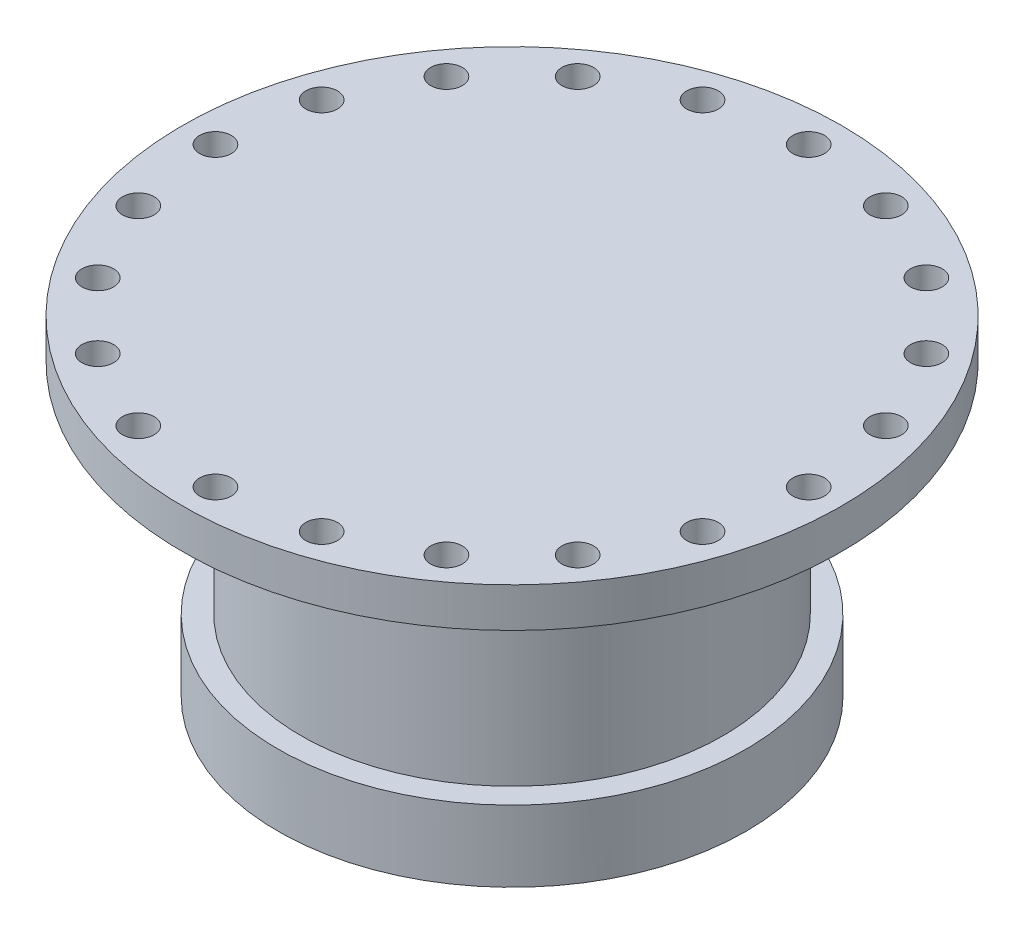
ISO-10303-21;
HEADER;
FILE_DESCRIPTION(('STEP AP214'),'2;1');
FILE_NAME('part.step','',(''),(''),'','','');
FILE_SCHEMA(('AUTOMOTIVE_DESIGN { 1 0 10303 214 1 1 1 1 }'));
ENDSEC;
DATA;
#1=APPLICATION_CONTEXT('core data for automotive mechanical design processes');
#2=APPLICATION_PROTOCOL_DEFINITION('international standard','automotive_design',2000,#1);
#3=PRODUCT_CONTEXT('',#1,'mechanical');
#4=PRODUCT('Part','Part','',(#3));
#5=PRODUCT_RELATED_PRODUCT_CATEGORY('part','',(#4));
#6=PRODUCT_DEFINITION_FORMATION('','',#4);
#7=PRODUCT_DEFINITION_CONTEXT('part definition',#1,'design');
#8=PRODUCT_DEFINITION('design','',#6,#7);
#9=PRODUCT_DEFINITION_SHAPE('','',#8);
#10=(LENGTH_UNIT() NAMED_UNIT(*) SI_UNIT(.MILLI.,.METRE.));
#11=(NAMED_UNIT(*) PLANE_ANGLE_UNIT() SI_UNIT($,.RADIAN.));
#12=(NAMED_UNIT(*) SI_UNIT($,.STERADIAN.) SOLID_ANGLE_UNIT());
#13=UNCERTAINTY_MEASURE_WITH_UNIT(LENGTH_MEASURE(1.E-05),#10,'distance_accuracy_value','');
#14=(GEOMETRIC_REPRESENTATION_CONTEXT(3) GLOBAL_UNCERTAINTY_ASSIGNED_CONTEXT((#13)) GLOBAL_UNIT_ASSIGNED_CONTEXT((#10,
#11,#12)) REPRESENTATION_CONTEXT('',''));
#15=CARTESIAN_POINT('',(0.,0.,0.));
#16=DIRECTION('',(0.,0.,1.));
#17=DIRECTION('',(1.,0.,0.));
#18=AXIS2_PLACEMENT_3D('',#15,#16,#17);
#19=CARTESIAN_POINT('',(0.,0.,0.));
#20=DIRECTION('',(0.,-1.,0.));
#21=DIRECTION('',(1.,0.,0.));
#22=AXIS2_PLACEMENT_3D('',#19,#20,#21);
#23=SPHERICAL_SURFACE('',#22,3950.);
#24=CARTESIAN_POINT('',(0.,3946.00985173631,0.));
#25=DIRECTION('',(0.,-1.,0.));
#26=DIRECTION('',(0.,0.,-1.));
#27=AXIS2_PLACEMENT_3D('',#24,#25,#26);
#28=CIRCLE('',#27,177.5);
#29=CARTESIAN_POINT('',(0.,3946.00985173631,-177.5));
#30=VERTEX_POINT('',#29);
#31=EDGE_CURVE('E10',#30,#30,#28,.T.);
#32=ORIENTED_EDGE('',*,*,#31,.T.);
#33=EDGE_LOOP('',(#32));
#34=FACE_BOUND('',#33,.T.);
#35=ADVANCED_FACE('F32',(#34),#23,.F.);
#36=CARTESIAN_POINT('',(0.,113.656700563518,0.));
#37=DIRECTION('',(0.,-1.,0.));
#38=DIRECTION('',(0.,0.,-1.));
#39=AXIS2_PLACEMENT_3D('',#36,#37,#38);
#40=CYLINDRICAL_SURFACE('',#39,177.5);
#41=CARTESIAN_POINT('',(0.,4000.,0.));
#42=DIRECTION('',(0.,-1.,0.));
#43=DIRECTION('',(0.,0.,-1.));
#44=AXIS2_PLACEMENT_3D('',#41,#42,#43);
#45=CIRCLE('',#44,177.5);
#46=CARTESIAN_POINT('',(0.,4000.,-177.5));
#47=VERTEX_POINT('',#46);
#48=EDGE_CURVE('E39',#47,#47,#45,.T.);
#49=ORIENTED_EDGE('',*,*,#48,.T.);
#50=EDGE_LOOP('',(#49));
#51=FACE_BOUND('',#50,.T.);
#52=ORIENTED_EDGE('',*,*,#31,.F.);
#53=EDGE_LOOP('',(#52));
#54=FACE_BOUND('',#53,.T.);
#55=ADVANCED_FACE('F272',(#51,#54),#40,.T.);
#56=CARTESIAN_POINT('',(160.,4000.,0.));
#57=DIRECTION('',(0.,1.,0.));
#58=DIRECTION('',(0.,0.,1.));
#59=AXIS2_PLACEMENT_3D('',#56,#57,#58);
#60=PLANE('',#59);
#61=CARTESIAN_POINT('',(0.,4000.,0.));
#62=DIRECTION('',(0.,-1.,0.));
#63=DIRECTION('',(0.,0.,-1.));
#64=AXIS2_PLACEMENT_3D('',#61,#62,#63);
#65=CIRCLE('',#64,160.);
#66=CARTESIAN_POINT('',(0.,4000.,-160.));
#67=VERTEX_POINT('',#66);
#68=EDGE_CURVE('E43',#67,#67,#65,.T.);
#69=ORIENTED_EDGE('',*,*,#68,.T.);
#70=EDGE_LOOP('',(#69));
#71=FACE_BOUND('',#70,.T.);
#72=ORIENTED_EDGE('',*,*,#48,.F.);
#73=EDGE_LOOP('',(#72));
#74=FACE_BOUND('',#73,.T.);
#75=ADVANCED_FACE('F266',(#71,#74),#60,.T.);
#76=CARTESIAN_POINT('',(0.,113.656700563518,0.));
#77=DIRECTION('',(0.,-1.,0.));
#78=DIRECTION('',(0.,0.,-1.));
#79=AXIS2_PLACEMENT_3D('',#76,#77,#78);
#80=CYLINDRICAL_SURFACE('',#79,160.);
#81=CARTESIAN_POINT('',(0.,4160.,0.));
#82=DIRECTION('',(0.,-1.,0.));
#83=DIRECTION('',(0.,0.,-1.));
#84=AXIS2_PLACEMENT_3D('',#81,#82,#83);
#85=CIRCLE('',#84,160.);
#86=CARTESIAN_POINT('',(0.,4160.,-160.));
#87=VERTEX_POINT('',#86);
#88=EDGE_CURVE('E47',#87,#87,#85,.T.);
#89=ORIENTED_EDGE('',*,*,#88,.T.);
#90=EDGE_LOOP('',(#89));
#91=FACE_BOUND('',#90,.T.);
#92=ORIENTED_EDGE('',*,*,#68,.F.);
#93=EDGE_LOOP('',(#92));
#94=FACE_BOUND('',#93,.T.);
#95=ADVANCED_FACE('F260',(#91,#94),#80,.T.);
#96=CARTESIAN_POINT('',(174.,4160.,0.));
#97=DIRECTION('',(0.,-1.,0.));
#98=DIRECTION('',(0.,0.,-1.));
#99=AXIS2_PLACEMENT_3D('',#96,#97,#98);
#100=PLANE('',#99);
#101=CARTESIAN_POINT('',(0.,4160.,0.));
#102=DIRECTION('',(0.,-1.,0.));
#103=DIRECTION('',(0.,0.,-1.));
#104=AXIS2_PLACEMENT_3D('',#101,#102,#103);
#105=CIRCLE('',#104,174.);
#106=CARTESIAN_POINT('',(0.,4160.,-174.));
#107=VERTEX_POINT('',#106);
#108=EDGE_CURVE('E52',#107,#107,#105,.T.);
#109=ORIENTED_EDGE('',*,*,#108,.T.);
#110=EDGE_LOOP('',(#109));
#111=FACE_BOUND('',#110,.T.);
#112=ORIENTED_EDGE('',*,*,#88,.F.);
#113=EDGE_LOOP('',(#112));
#114=FACE_BOUND('',#113,.T.);
#115=ADVANCED_FACE('F254',(#111,#114),#100,.T.);
#116=CARTESIAN_POINT('',(0.,4160.,0.));
#117=DIRECTION('',(0.,1.,0.));
#118=DIRECTION('',(0.,0.,1.));
#119=AXIS2_PLACEMENT_3D('',#116,#117,#118);
#120=CONICAL_SURFACE('',#119,174.,0.78539816339743);
#121=CARTESIAN_POINT('',(0.,4166.,0.));
#122=DIRECTION('',(0.,-1.,0.));
#123=DIRECTION('',(0.,0.,-1.));
#124=AXIS2_PLACEMENT_3D('',#121,#122,#123);
#125=CIRCLE('',#124,180.);
#126=CARTESIAN_POINT('',(0.,4166.,-180.));
#127=VERTEX_POINT('',#126);
#128=EDGE_CURVE('E55',#127,#127,#125,.T.);
#129=ORIENTED_EDGE('',*,*,#128,.T.);
#130=EDGE_LOOP('',(#129));
#131=FACE_BOUND('',#130,.T.);
#132=ORIENTED_EDGE('',*,*,#108,.F.);
#133=EDGE_LOOP('',(#132));
#134=FACE_BOUND('',#133,.T.);
#135=ADVANCED_FACE('F247',(#131,#134),#120,.T.);
#136=CARTESIAN_POINT('',(250.,4166.,0.));
#137=DIRECTION('',(0.,-1.,0.));
#138=DIRECTION('',(0.,0.,-1.));
#139=AXIS2_PLACEMENT_3D('',#136,#137,#138);
#140=PLANE('',#139);
#141=CARTESIAN_POINT('',(-69.5288237343604,4166.,-213.98771616641));
#142=DIRECTION('',(0.,-1.,0.));
#143=DIRECTION('',(0.,0.,-1.));
#144=AXIS2_PLACEMENT_3D('',#141,#142,#143);
#145=CIRCLE('',#144,12.);
#146=CARTESIAN_POINT('',(-69.5288237343604,4166.,-225.98771616641));
#147=VERTEX_POINT('',#146);
#148=EDGE_CURVE('E184',#147,#147,#145,.T.);
#149=ORIENTED_EDGE('',*,*,#148,.F.);
#150=EDGE_LOOP('',(#149));
#151=FACE_BOUND('',#150,.T.);
#152=CARTESIAN_POINT('',(-132.251681765805,4166.,-182.028823734358));
#153=DIRECTION('',(0.,-1.,0.));
#154=DIRECTION('',(0.,0.,-1.));
#155=AXIS2_PLACEMENT_3D('',#152,#153,#154);
#156=CIRCLE('',#155,12.0000000000062);
#157=CARTESIAN_POINT('',(-132.251681765805,4166.,-194.028823734364));
#158=VERTEX_POINT('',#157);
#159=EDGE_CURVE('E178',#158,#158,#156,.T.);
#160=ORIENTED_EDGE('',*,*,#159,.F.);
#161=EDGE_LOOP('',(#160));
#162=FACE_BOUND('',#161,.T.);
#163=CARTESIAN_POINT('',(-182.028823734359,4166.,-132.251681765799));
#164=DIRECTION('',(0.,-1.,0.));
#165=DIRECTION('',(0.,0.,-1.));
#166=AXIS2_PLACEMENT_3D('',#163,#164,#165);
#167=CIRCLE('',#166,12.0000000000087);
#168=CARTESIAN_POINT('',(-182.028823734359,4166.,-144.251681765807));
#169=VERTEX_POINT('',#168);
#170=EDGE_CURVE('E172',#169,#169,#167,.T.);
#171=ORIENTED_EDGE('',*,*,#170,.F.);
#172=EDGE_LOOP('',(#171));
#173=FACE_BOUND('',#172,.T.);
#174=CARTESIAN_POINT('',(-213.987716166403,4166.,-69.528823734354));
#175=DIRECTION('',(0.,-1.,0.));
#176=DIRECTION('',(0.,0.,-1.));
#177=AXIS2_PLACEMENT_3D('',#174,#175,#176);
#178=CIRCLE('',#177,12.0000000000115);
#179=CARTESIAN_POINT('',(-213.987716166403,4166.,-81.5288237343655));
#180=VERTEX_POINT('',#179);
#181=EDGE_CURVE('E166',#180,#180,#178,.T.);
#182=ORIENTED_EDGE('',*,*,#181,.F.);
#183=EDGE_LOOP('',(#182));
#184=FACE_BOUND('',#183,.T.);
#185=CARTESIAN_POINT('',(-224.99999999999,4166.,9.59232693276135E-12));
#186=DIRECTION('',(0.,-1.,0.));
#187=DIRECTION('',(0.,0.,-1.));
#188=AXIS2_PLACEMENT_3D('',#185,#186,#187);
#189=CIRCLE('',#188,12.0000000000142);
#190=CARTESIAN_POINT('',(-224.99999999999,4166.,-12.0000000000046));
#191=VERTEX_POINT('',#190);
#192=EDGE_CURVE('E160',#191,#191,#189,.T.);
#193=ORIENTED_EDGE('',*,*,#192,.F.);
#194=EDGE_LOOP('',(#193));
#195=FACE_BOUND('',#194,.T.);
#196=CARTESIAN_POINT('',(-213.987716166397,4166.,69.5288237343723));
#197=DIRECTION('',(0.,-1.,0.));
#198=DIRECTION('',(0.,0.,-1.));
#199=AXIS2_PLACEMENT_3D('',#196,#197,#198);
#200=CIRCLE('',#199,12.0000000000167);
#201=CARTESIAN_POINT('',(-213.987716166397,4166.,57.5288237343556));
#202=VERTEX_POINT('',#201);
#203=EDGE_CURVE('E154',#202,#202,#200,.T.);
#204=ORIENTED_EDGE('',*,*,#203,.F.);
#205=EDGE_LOOP('',(#204));
#206=FACE_BOUND('',#205,.T.);
#207=CARTESIAN_POINT('',(-182.028823734348,4166.,132.251681765814));
#208=DIRECTION('',(0.,-1.,0.));
#209=DIRECTION('',(0.,0.,-1.));
#210=AXIS2_PLACEMENT_3D('',#207,#208,#209);
#211=CIRCLE('',#210,12.0000000000188);
#212=CARTESIAN_POINT('',(-182.028823734348,4166.,120.251681765795));
#213=VERTEX_POINT('',#212);
#214=EDGE_CURVE('E148',#213,#213,#211,.T.);
#215=ORIENTED_EDGE('',*,*,#214,.F.);
#216=EDGE_LOOP('',(#215));
#217=FACE_BOUND('',#216,.T.);
#218=CARTESIAN_POINT('',(-132.251681765789,4166.,182.028823734369));
#219=DIRECTION('',(0.,-1.,0.));
#220=DIRECTION('',(0.,0.,-1.));
#221=AXIS2_PLACEMENT_3D('',#218,#219,#220);
#222=CIRCLE('',#221,12.0000000000201);
#223=CARTESIAN_POINT('',(-132.251681765789,4166.,170.028823734349));
#224=VERTEX_POINT('',#223);
#225=EDGE_CURVE('E142',#224,#224,#222,.T.);
#226=ORIENTED_EDGE('',*,*,#225,.F.);
#227=EDGE_LOOP('',(#226));
#228=FACE_BOUND('',#227,.T.);
#229=CARTESIAN_POINT('',(-69.5288237343445,4166.,213.987716166413));
#230=DIRECTION('',(0.,-1.,0.));
#231=DIRECTION('',(0.,0.,-1.));
#232=AXIS2_PLACEMENT_3D('',#229,#230,#231);
#233=CIRCLE('',#232,12.0000000000204);
#234=CARTESIAN_POINT('',(-69.5288237343445,4166.,201.987716166392));
#235=VERTEX_POINT('',#234);
#236=EDGE_CURVE('E136',#235,#235,#233,.T.);
#237=ORIENTED_EDGE('',*,*,#236,.F.);
#238=EDGE_LOOP('',(#237));
#239=FACE_BOUND('',#238,.T.);
#240=CARTESIAN_POINT('',(1.91295447595611E-11,4166.,225.));
#241=DIRECTION('',(0.,-1.,0.));
#242=DIRECTION('',(0.,0.,-1.));
#243=AXIS2_PLACEMENT_3D('',#240,#241,#242);
#244=CIRCLE('',#243,12.0000000000198);
#245=CARTESIAN_POINT('',(1.91295447595611E-11,4166.,212.99999999998));
#246=VERTEX_POINT('',#245);
#247=EDGE_CURVE('E130',#246,#246,#244,.T.);
#248=ORIENTED_EDGE('',*,*,#247,.F.);
#249=EDGE_LOOP('',(#248));
#250=FACE_BOUND('',#249,.T.);
#251=CARTESIAN_POINT('',(69.5288237343818,4166.,213.987716166407));
#252=DIRECTION('',(0.,-1.,0.));
#253=DIRECTION('',(0.,0.,-1.));
#254=AXIS2_PLACEMENT_3D('',#251,#252,#253);
#255=CIRCLE('',#254,12.0000000000184);
#256=CARTESIAN_POINT('',(69.5288237343818,4166.,201.987716166388));
#257=VERTEX_POINT('',#256);
#258=EDGE_CURVE('E124',#257,#257,#255,.T.);
#259=ORIENTED_EDGE('',*,*,#258,.F.);
#260=EDGE_LOOP('',(#259));
#261=FACE_BOUND('',#260,.T.);
#262=CARTESIAN_POINT('',(132.251681765824,4166.,182.028823734358));
#263=DIRECTION('',(0.,-1.,0.));
#264=DIRECTION('',(0.,0.,-1.));
#265=AXIS2_PLACEMENT_3D('',#262,#263,#264);
#266=CIRCLE('',#265,12.0000000000162);
#267=CARTESIAN_POINT('',(132.251681765824,4166.,170.028823734341));
#268=VERTEX_POINT('',#267);
#269=EDGE_CURVE('E118',#268,#268,#266,.T.);
#270=ORIENTED_EDGE('',*,*,#269,.F.);
#271=EDGE_LOOP('',(#270));
#272=FACE_BOUND('',#271,.T.);
#273=CARTESIAN_POINT('',(182.028823734378,4166.,132.251681765799));
#274=DIRECTION('',(0.,-1.,0.));
#275=DIRECTION('',(0.,0.,-1.));
#276=AXIS2_PLACEMENT_3D('',#273,#274,#275);
#277=CIRCLE('',#276,12.0000000000133);
#278=CARTESIAN_POINT('',(182.028823734378,4166.,120.251681765785));
#279=VERTEX_POINT('',#278);
#280=EDGE_CURVE('E112',#279,#279,#277,.T.);
#281=ORIENTED_EDGE('',*,*,#280,.F.);
#282=EDGE_LOOP('',(#281));
#283=FACE_BOUND('',#282,.T.);
#284=CARTESIAN_POINT('',(213.987716166422,4166.,69.5288237343541));
#285=DIRECTION('',(0.,-1.,0.));
#286=DIRECTION('',(0.,0.,-1.));
#287=AXIS2_PLACEMENT_3D('',#284,#285,#286);
#288=CIRCLE('',#287,12.0000000000103);
#289=CARTESIAN_POINT('',(213.987716166422,4166.,57.5288237343438));
#290=VERTEX_POINT('',#289);
#291=EDGE_CURVE('E106',#290,#290,#288,.T.);
#292=ORIENTED_EDGE('',*,*,#291,.F.);
#293=EDGE_LOOP('',(#292));
#294=FACE_BOUND('',#293,.T.);
#295=CARTESIAN_POINT('',(225.00000000001,4166.,-9.56477237978054E-12));
#296=DIRECTION('',(0.,-1.,0.));
#297=DIRECTION('',(0.,0.,-1.));
#298=AXIS2_PLACEMENT_3D('',#295,#296,#297);
#299=CIRCLE('',#298,12.0000000000071);
#300=CARTESIAN_POINT('',(225.00000000001,4166.,-12.0000000000167));
#301=VERTEX_POINT('',#300);
#302=EDGE_CURVE('E100',#301,#301,#299,.T.);
#303=ORIENTED_EDGE('',*,*,#302,.F.);
#304=EDGE_LOOP('',(#303));
#305=FACE_BOUND('',#304,.T.);
#306=CARTESIAN_POINT('',(213.987716166416,4166.,-69.5288237343723));
#307=DIRECTION('',(0.,-1.,0.));
#308=DIRECTION('',(0.,0.,-1.));
#309=AXIS2_PLACEMENT_3D('',#306,#307,#308);
#310=CIRCLE('',#309,12.0000000000043);
#311=CARTESIAN_POINT('',(213.987716166416,4166.,-81.5288237343766));
#312=VERTEX_POINT('',#311);
#313=EDGE_CURVE('E94',#312,#312,#310,.T.);
#314=ORIENTED_EDGE('',*,*,#313,.F.);
#315=EDGE_LOOP('',(#314));
#316=FACE_BOUND('',#315,.T.);
#317=CARTESIAN_POINT('',(182.028823734367,4166.,-132.251681765814));
#318=DIRECTION('',(0.,-1.,0.));
#319=DIRECTION('',(0.,0.,-1.));
#320=AXIS2_PLACEMENT_3D('',#317,#318,#319);
#321=CIRCLE('',#320,12.000000000002);
#322=CARTESIAN_POINT('',(182.028823734367,4166.,-144.251681765816));
#323=VERTEX_POINT('',#322);
#324=EDGE_CURVE('E88',#323,#323,#321,.T.);
#325=ORIENTED_EDGE('',*,*,#324,.F.);
#326=EDGE_LOOP('',(#325));
#327=FACE_BOUND('',#326,.T.);
#328=CARTESIAN_POINT('',(132.251681765808,4166.,-182.028823734369));
#329=DIRECTION('',(0.,-1.,0.));
#330=DIRECTION('',(0.,0.,-1.));
#331=AXIS2_PLACEMENT_3D('',#328,#329,#330);
#332=CIRCLE('',#331,12.0000000000004);
#333=CARTESIAN_POINT('',(132.251681765808,4166.,-194.028823734369));
#334=VERTEX_POINT('',#333);
#335=EDGE_CURVE('E82',#334,#334,#332,.T.);
#336=ORIENTED_EDGE('',*,*,#335,.F.);
#337=EDGE_LOOP('',(#336));
#338=FACE_BOUND('',#337,.T.);
#339=CARTESIAN_POINT('',(69.5288237343633,4166.,-213.98771616641));
#340=DIRECTION('',(0.,-1.,0.));
#341=DIRECTION('',(0.,0.,-1.));
#342=AXIS2_PLACEMENT_3D('',#339,#340,#341);
#343=CIRCLE('',#342,12.);
#344=CARTESIAN_POINT('',(69.5288237343633,4166.,-225.98771616641));
#345=VERTEX_POINT('',#344);
#346=EDGE_CURVE('E76',#345,#345,#343,.T.);
#347=ORIENTED_EDGE('',*,*,#346,.F.);
#348=EDGE_LOOP('',(#347));
#349=FACE_BOUND('',#348,.T.);
#350=CARTESIAN_POINT('',(0.,4166.,-225.));
#351=DIRECTION('',(0.,-1.,0.));
#352=DIRECTION('',(0.,0.,-1.));
#353=AXIS2_PLACEMENT_3D('',#350,#351,#352);
#354=CIRCLE('',#353,12.);
#355=CARTESIAN_POINT('',(0.,4166.,-237.));
#356=VERTEX_POINT('',#355);
#357=EDGE_CURVE('E70',#356,#356,#354,.T.);
#358=ORIENTED_EDGE('',*,*,#357,.F.);
#359=EDGE_LOOP('',(#358));
#360=FACE_BOUND('',#359,.T.);
#361=CARTESIAN_POINT('',(0.,4166.,0.));
#362=DIRECTION('',(0.,-1.,0.));
#363=DIRECTION('',(0.,0.,-1.));
#364=AXIS2_PLACEMENT_3D('',#361,#362,#363);
#365=CIRCLE('',#364,250.);
#366=CARTESIAN_POINT('',(0.,4166.,-250.));
#367=VERTEX_POINT('',#366);
#368=EDGE_CURVE('E58',#367,#367,#365,.T.);
#369=ORIENTED_EDGE('',*,*,#368,.T.);
#370=EDGE_LOOP('',(#369));
#371=FACE_BOUND('',#370,.T.);
#372=ORIENTED_EDGE('',*,*,#128,.F.);
#373=EDGE_LOOP('',(#372));
#374=FACE_BOUND('',#373,.T.);
#375=ADVANCED_FACE('F241',(#151,#162,#173,#184,#195,#206,#217,#228,#239,#250,#261,#272,#283,
#294,#305,#316,#327,#338,#349,#360,#371,#374),#140,.T.);
#376=CARTESIAN_POINT('',(0.,113.656700563518,0.));
#377=DIRECTION('',(0.,-1.,0.));
#378=DIRECTION('',(0.,0.,-1.));
#379=AXIS2_PLACEMENT_3D('',#376,#377,#378);
#380=CYLINDRICAL_SURFACE('',#379,250.);
#381=CARTESIAN_POINT('',(0.,4196.,0.));
#382=DIRECTION('',(0.,-1.,0.));
#383=DIRECTION('',(0.,0.,-1.));
#384=AXIS2_PLACEMENT_3D('',#381,#382,#383);
#385=CIRCLE('',#384,250.);
#386=CARTESIAN_POINT('',(0.,4196.,-250.));
#387=VERTEX_POINT('',#386);
#388=EDGE_CURVE('E61',#387,#387,#385,.T.);
#389=ORIENTED_EDGE('',*,*,#388,.T.);
#390=EDGE_LOOP('',(#389));
#391=FACE_BOUND('',#390,.T.);
#392=ORIENTED_EDGE('',*,*,#368,.F.);
#393=EDGE_LOOP('',(#392));
#394=FACE_BOUND('',#393,.T.);
#395=ADVANCED_FACE('F197',(#391,#394),#380,.T.);
#396=CARTESIAN_POINT('',(0.,4196.,0.));
#397=DIRECTION('',(0.,1.,0.));
#398=DIRECTION('',(0.,0.,1.));
#399=AXIS2_PLACEMENT_3D('',#396,#397,#398);
#400=PLANE('',#399);
#401=CARTESIAN_POINT('',(-69.5288237343604,4196.,-213.98771616641));
#402=DIRECTION('',(0.,1.,0.));
#403=DIRECTION('',(0.,0.,1.));
#404=AXIS2_PLACEMENT_3D('',#401,#402,#403);
#405=CIRCLE('',#404,12.);
#406=CARTESIAN_POINT('',(-69.5288237343604,4196.,-201.98771616641));
#407=VERTEX_POINT('',#406);
#408=EDGE_CURVE('E187',#407,#407,#405,.T.);
#409=ORIENTED_EDGE('',*,*,#408,.F.);
#410=EDGE_LOOP('',(#409));
#411=FACE_BOUND('',#410,.T.);
#412=CARTESIAN_POINT('',(-132.251681765805,4196.,-182.028823734358));
#413=DIRECTION('',(0.,1.,0.));
#414=DIRECTION('',(0.,0.,1.));
#415=AXIS2_PLACEMENT_3D('',#412,#413,#414);
#416=CIRCLE('',#415,12.0000000000062);
#417=CARTESIAN_POINT('',(-132.251681765805,4196.,-170.028823734351));
#418=VERTEX_POINT('',#417);
#419=EDGE_CURVE('E181',#418,#418,#416,.T.);
#420=ORIENTED_EDGE('',*,*,#419,.F.);
#421=EDGE_LOOP('',(#420));
#422=FACE_BOUND('',#421,.T.);
#423=CARTESIAN_POINT('',(-182.028823734359,4196.,-132.251681765799));
#424=DIRECTION('',(0.,1.,0.));
#425=DIRECTION('',(0.,0.,1.));
#426=AXIS2_PLACEMENT_3D('',#423,#424,#425);
#427=CIRCLE('',#426,12.0000000000087);
#428=CARTESIAN_POINT('',(-182.028823734359,4196.,-120.25168176579));
#429=VERTEX_POINT('',#428);
#430=EDGE_CURVE('E175',#429,#429,#427,.T.);
#431=ORIENTED_EDGE('',*,*,#430,.F.);
#432=EDGE_LOOP('',(#431));
#433=FACE_BOUND('',#432,.T.);
#434=CARTESIAN_POINT('',(-213.987716166403,4196.,-69.528823734354));
#435=DIRECTION('',(0.,1.,0.));
#436=DIRECTION('',(0.,0.,1.));
#437=AXIS2_PLACEMENT_3D('',#434,#435,#436);
#438=CIRCLE('',#437,12.0000000000115);
#439=CARTESIAN_POINT('',(-213.987716166403,4196.,-57.5288237343426));
#440=VERTEX_POINT('',#439);
#441=EDGE_CURVE('E169',#440,#440,#438,.T.);
#442=ORIENTED_EDGE('',*,*,#441,.F.);
#443=EDGE_LOOP('',(#442));
#444=FACE_BOUND('',#443,.T.);
#445=CARTESIAN_POINT('',(-224.99999999999,4196.,9.59232693276135E-12));
#446=DIRECTION('',(0.,1.,0.));
#447=DIRECTION('',(0.,0.,1.));
#448=AXIS2_PLACEMENT_3D('',#445,#446,#447);
#449=CIRCLE('',#448,12.0000000000142);
#450=CARTESIAN_POINT('',(-224.99999999999,4196.,12.0000000000238));
#451=VERTEX_POINT('',#450);
#452=EDGE_CURVE('E163',#451,#451,#449,.T.);
#453=ORIENTED_EDGE('',*,*,#452,.F.);
#454=EDGE_LOOP('',(#453));
#455=FACE_BOUND('',#454,.T.);
#456=CARTESIAN_POINT('',(-213.987716166397,4196.,69.5288237343723));
#457=DIRECTION('',(0.,1.,0.));
#458=DIRECTION('',(0.,0.,1.));
#459=AXIS2_PLACEMENT_3D('',#456,#457,#458);
#460=CIRCLE('',#459,12.0000000000167);
#461=CARTESIAN_POINT('',(-213.987716166397,4196.,81.528823734389));
#462=VERTEX_POINT('',#461);
#463=EDGE_CURVE('E157',#462,#462,#460,.T.);
#464=ORIENTED_EDGE('',*,*,#463,.F.);
#465=EDGE_LOOP('',(#464));
#466=FACE_BOUND('',#465,.T.);
#467=CARTESIAN_POINT('',(-182.028823734348,4196.,132.251681765814));
#468=DIRECTION('',(0.,1.,0.));
#469=DIRECTION('',(0.,0.,1.));
#470=AXIS2_PLACEMENT_3D('',#467,#468,#469);
#471=CIRCLE('',#470,12.0000000000188);
#472=CARTESIAN_POINT('',(-182.028823734348,4196.,144.251681765833));
#473=VERTEX_POINT('',#472);
#474=EDGE_CURVE('E151',#473,#473,#471,.T.);
#475=ORIENTED_EDGE('',*,*,#474,.F.);
#476=EDGE_LOOP('',(#475));
#477=FACE_BOUND('',#476,.T.);
#478=CARTESIAN_POINT('',(-132.251681765789,4196.,182.028823734369));
#479=DIRECTION('',(0.,1.,0.));
#480=DIRECTION('',(0.,0.,1.));
#481=AXIS2_PLACEMENT_3D('',#478,#479,#480);
#482=CIRCLE('',#481,12.0000000000201);
#483=CARTESIAN_POINT('',(-132.251681765789,4196.,194.028823734389));
#484=VERTEX_POINT('',#483);
#485=EDGE_CURVE('E145',#484,#484,#482,.T.);
#486=ORIENTED_EDGE('',*,*,#485,.F.);
#487=EDGE_LOOP('',(#486));
#488=FACE_BOUND('',#487,.T.);
#489=CARTESIAN_POINT('',(-69.5288237343445,4196.,213.987716166413));
#490=DIRECTION('',(0.,1.,0.));
#491=DIRECTION('',(0.,0.,1.));
#492=AXIS2_PLACEMENT_3D('',#489,#490,#491);
#493=CIRCLE('',#492,12.0000000000204);
#494=CARTESIAN_POINT('',(-69.5288237343445,4196.,225.987716166433));
#495=VERTEX_POINT('',#494);
#496=EDGE_CURVE('E139',#495,#495,#493,.T.);
#497=ORIENTED_EDGE('',*,*,#496,.F.);
#498=EDGE_LOOP('',(#497));
#499=FACE_BOUND('',#498,.T.);
#500=CARTESIAN_POINT('',(1.91295447595611E-11,4196.,225.));
#501=DIRECTION('',(0.,1.,0.));
#502=DIRECTION('',(0.,0.,1.));
#503=AXIS2_PLACEMENT_3D('',#500,#501,#502);
#504=CIRCLE('',#503,12.0000000000198);
#505=CARTESIAN_POINT('',(1.91295447595611E-11,4196.,237.00000000002));
#506=VERTEX_POINT('',#505);
#507=EDGE_CURVE('E133',#506,#506,#504,.T.);
#508=ORIENTED_EDGE('',*,*,#507,.F.);
#509=EDGE_LOOP('',(#508));
#510=FACE_BOUND('',#509,.T.);
#511=CARTESIAN_POINT('',(69.5288237343818,4196.,213.987716166407));
#512=DIRECTION('',(0.,1.,0.));
#513=DIRECTION('',(0.,0.,1.));
#514=AXIS2_PLACEMENT_3D('',#511,#512,#513);
#515=CIRCLE('',#514,12.0000000000184);
#516=CARTESIAN_POINT('',(69.5288237343818,4196.,225.987716166425));
#517=VERTEX_POINT('',#516);
#518=EDGE_CURVE('E127',#517,#517,#515,.T.);
#519=ORIENTED_EDGE('',*,*,#518,.F.);
#520=EDGE_LOOP('',(#519));
#521=FACE_BOUND('',#520,.T.);
#522=CARTESIAN_POINT('',(132.251681765824,4196.,182.028823734358));
#523=DIRECTION('',(0.,1.,0.));
#524=DIRECTION('',(0.,0.,1.));
#525=AXIS2_PLACEMENT_3D('',#522,#523,#524);
#526=CIRCLE('',#525,12.0000000000162);
#527=CARTESIAN_POINT('',(132.251681765824,4196.,194.028823734374));
#528=VERTEX_POINT('',#527);
#529=EDGE_CURVE('E121',#528,#528,#526,.T.);
#530=ORIENTED_EDGE('',*,*,#529,.F.);
#531=EDGE_LOOP('',(#530));
#532=FACE_BOUND('',#531,.T.);
#533=CARTESIAN_POINT('',(182.028823734378,4196.,132.251681765799));
#534=DIRECTION('',(0.,1.,0.));
#535=DIRECTION('',(0.,0.,1.));
#536=AXIS2_PLACEMENT_3D('',#533,#534,#535);
#537=CIRCLE('',#536,12.0000000000133);
#538=CARTESIAN_POINT('',(182.028823734378,4196.,144.251681765812));
#539=VERTEX_POINT('',#538);
#540=EDGE_CURVE('E115',#539,#539,#537,.T.);
#541=ORIENTED_EDGE('',*,*,#540,.F.);
#542=EDGE_LOOP('',(#541));
#543=FACE_BOUND('',#542,.T.);
#544=CARTESIAN_POINT('',(213.987716166422,4196.,69.5288237343541));
#545=DIRECTION('',(0.,1.,0.));
#546=DIRECTION('',(0.,0.,1.));
#547=AXIS2_PLACEMENT_3D('',#544,#545,#546);
#548=CIRCLE('',#547,12.0000000000103);
#549=CARTESIAN_POINT('',(213.987716166422,4196.,81.5288237343644));
#550=VERTEX_POINT('',#549);
#551=EDGE_CURVE('E109',#550,#550,#548,.T.);
#552=ORIENTED_EDGE('',*,*,#551,.F.);
#553=EDGE_LOOP('',(#552));
#554=FACE_BOUND('',#553,.T.);
#555=CARTESIAN_POINT('',(225.00000000001,4196.,-9.56477237978054E-12));
#556=DIRECTION('',(0.,1.,0.));
#557=DIRECTION('',(0.,0.,1.));
#558=AXIS2_PLACEMENT_3D('',#555,#556,#557);
#559=CIRCLE('',#558,12.0000000000071);
#560=CARTESIAN_POINT('',(225.00000000001,4196.,11.9999999999976));
#561=VERTEX_POINT('',#560);
#562=EDGE_CURVE('E103',#561,#561,#559,.T.);
#563=ORIENTED_EDGE('',*,*,#562,.F.);
#564=EDGE_LOOP('',(#563));
#565=FACE_BOUND('',#564,.T.);
#566=CARTESIAN_POINT('',(213.987716166416,4196.,-69.5288237343723));
#567=DIRECTION('',(0.,1.,0.));
#568=DIRECTION('',(0.,0.,1.));
#569=AXIS2_PLACEMENT_3D('',#566,#567,#568);
#570=CIRCLE('',#569,12.0000000000043);
#571=CARTESIAN_POINT('',(213.987716166416,4196.,-57.528823734368));
#572=VERTEX_POINT('',#571);
#573=EDGE_CURVE('E97',#572,#572,#570,.T.);
#574=ORIENTED_EDGE('',*,*,#573,.F.);
#575=EDGE_LOOP('',(#574));
#576=FACE_BOUND('',#575,.T.);
#577=CARTESIAN_POINT('',(182.028823734367,4196.,-132.251681765814));
#578=DIRECTION('',(0.,1.,0.));
#579=DIRECTION('',(0.,0.,1.));
#580=AXIS2_PLACEMENT_3D('',#577,#578,#579);
#581=CIRCLE('',#580,12.000000000002);
#582=CARTESIAN_POINT('',(182.028823734367,4196.,-120.251681765812));
#583=VERTEX_POINT('',#582);
#584=EDGE_CURVE('E91',#583,#583,#581,.T.);
#585=ORIENTED_EDGE('',*,*,#584,.F.);
#586=EDGE_LOOP('',(#585));
#587=FACE_BOUND('',#586,.T.);
#588=CARTESIAN_POINT('',(132.251681765808,4196.,-182.028823734369));
#589=DIRECTION('',(0.,1.,0.));
#590=DIRECTION('',(0.,0.,1.));
#591=AXIS2_PLACEMENT_3D('',#588,#589,#590);
#592=CIRCLE('',#591,12.0000000000004);
#593=CARTESIAN_POINT('',(132.251681765808,4196.,-170.028823734368));
#594=VERTEX_POINT('',#593);
#595=EDGE_CURVE('E85',#594,#594,#592,.T.);
#596=ORIENTED_EDGE('',*,*,#595,.F.);
#597=EDGE_LOOP('',(#596));
#598=FACE_BOUND('',#597,.T.);
#599=CARTESIAN_POINT('',(69.5288237343633,4196.,-213.98771616641));
#600=DIRECTION('',(0.,1.,0.));
#601=DIRECTION('',(0.,0.,1.));
#602=AXIS2_PLACEMENT_3D('',#599,#600,#601);
#603=CIRCLE('',#602,12.);
#604=CARTESIAN_POINT('',(69.5288237343633,4196.,-201.98771616641));
#605=VERTEX_POINT('',#604);
#606=EDGE_CURVE('E79',#605,#605,#603,.T.);
#607=ORIENTED_EDGE('',*,*,#606,.F.);
#608=EDGE_LOOP('',(#607));
#609=FACE_BOUND('',#608,.T.);
#610=CARTESIAN_POINT('',(0.,4196.,-225.));
#611=DIRECTION('',(0.,1.,0.));
#612=DIRECTION('',(0.,0.,1.));
#613=AXIS2_PLACEMENT_3D('',#610,#611,#612);
#614=CIRCLE('',#613,12.);
#615=CARTESIAN_POINT('',(0.,4196.,-213.));
#616=VERTEX_POINT('',#615);
#617=EDGE_CURVE('E73',#616,#616,#614,.T.);
#618=ORIENTED_EDGE('',*,*,#617,.F.);
#619=EDGE_LOOP('',(#618));
#620=FACE_BOUND('',#619,.T.);
#621=ORIENTED_EDGE('',*,*,#388,.F.);
#622=EDGE_LOOP('',(#621));
#623=FACE_BOUND('',#622,.T.);
#624=ADVANCED_FACE('F193',(#411,#422,#433,#444,#455,#466,#477,#488,#499,#510,#521,#532,#543,
#554,#565,#576,#587,#598,#609,#620,#623),#400,.T.);
#625=CARTESIAN_POINT('',(0.,3946.00985173631,-225.));
#626=DIRECTION('',(0.,1.,0.));
#627=DIRECTION('',(0.,0.,1.));
#628=AXIS2_PLACEMENT_3D('',#625,#626,#627);
#629=CYLINDRICAL_SURFACE('',#628,12.);
#630=ORIENTED_EDGE('',*,*,#357,.T.);
#631=EDGE_LOOP('',(#630));
#632=FACE_BOUND('',#631,.T.);
#633=ORIENTED_EDGE('',*,*,#617,.T.);
#634=EDGE_LOOP('',(#633));
#635=FACE_BOUND('',#634,.T.);
#636=ADVANCED_FACE('F196',(#632,#635),#629,.F.);
#637=CARTESIAN_POINT('',(69.5288237343633,3946.00985173631,-213.98771616641));
#638=DIRECTION('',(0.,1.,0.));
#639=DIRECTION('',(0.,0.,1.));
#640=AXIS2_PLACEMENT_3D('',#637,#638,#639);
#641=CYLINDRICAL_SURFACE('',#640,12.);
#642=ORIENTED_EDGE('',*,*,#346,.T.);
#643=EDGE_LOOP('',(#642));
#644=FACE_BOUND('',#643,.T.);
#645=ORIENTED_EDGE('',*,*,#606,.T.);
#646=EDGE_LOOP('',(#645));
#647=FACE_BOUND('',#646,.T.);
#648=ADVANCED_FACE('F360',(#644,#647),#641,.F.);
#649=CARTESIAN_POINT('',(132.251681765808,3946.00985173631,-182.028823734369));
#650=DIRECTION('',(0.,1.,0.));
#651=DIRECTION('',(0.,0.,1.));
#652=AXIS2_PLACEMENT_3D('',#649,#650,#651);
#653=CYLINDRICAL_SURFACE('',#652,12.0000000000004);
#654=ORIENTED_EDGE('',*,*,#335,.T.);
#655=EDGE_LOOP('',(#654));
#656=FACE_BOUND('',#655,.T.);
#657=ORIENTED_EDGE('',*,*,#595,.T.);
#658=EDGE_LOOP('',(#657));
#659=FACE_BOUND('',#658,.T.);
#660=ADVANCED_FACE('F370',(#656,#659),#653,.F.);
#661=CARTESIAN_POINT('',(182.028823734367,3946.00985173631,-132.251681765814));
#662=DIRECTION('',(0.,1.,0.));
#663=DIRECTION('',(0.,0.,1.));
#664=AXIS2_PLACEMENT_3D('',#661,#662,#663);
#665=CYLINDRICAL_SURFACE('',#664,12.000000000002);
#666=ORIENTED_EDGE('',*,*,#324,.T.);
#667=EDGE_LOOP('',(#666));
#668=FACE_BOUND('',#667,.T.);
#669=ORIENTED_EDGE('',*,*,#584,.T.);
#670=EDGE_LOOP('',(#669));
#671=FACE_BOUND('',#670,.T.);
#672=ADVANCED_FACE('F380',(#668,#671),#665,.F.);
#673=CARTESIAN_POINT('',(213.987716166416,3946.00985173631,-69.5288237343723));
#674=DIRECTION('',(0.,1.,0.));
#675=DIRECTION('',(0.,0.,1.));
#676=AXIS2_PLACEMENT_3D('',#673,#674,#675);
#677=CYLINDRICAL_SURFACE('',#676,12.0000000000043);
#678=ORIENTED_EDGE('',*,*,#313,.T.);
#679=EDGE_LOOP('',(#678));
#680=FACE_BOUND('',#679,.T.);
#681=ORIENTED_EDGE('',*,*,#573,.T.);
#682=EDGE_LOOP('',(#681));
#683=FACE_BOUND('',#682,.T.);
#684=ADVANCED_FACE('F390',(#680,#683),#677,.F.);
#685=CARTESIAN_POINT('',(225.00000000001,3946.00985173631,-9.56477237978054E-12));
#686=DIRECTION('',(0.,1.,0.));
#687=DIRECTION('',(0.,0.,1.));
#688=AXIS2_PLACEMENT_3D('',#685,#686,#687);
#689=CYLINDRICAL_SURFACE('',#688,12.0000000000071);
#690=ORIENTED_EDGE('',*,*,#302,.T.);
#691=EDGE_LOOP('',(#690));
#692=FACE_BOUND('',#691,.T.);
#693=ORIENTED_EDGE('',*,*,#562,.T.);
#694=EDGE_LOOP('',(#693));
#695=FACE_BOUND('',#694,.T.);
#696=ADVANCED_FACE('F400',(#692,#695),#689,.F.);
#697=CARTESIAN_POINT('',(213.987716166422,3946.00985173631,69.5288237343541));
#698=DIRECTION('',(0.,1.,0.));
#699=DIRECTION('',(0.,0.,1.));
#700=AXIS2_PLACEMENT_3D('',#697,#698,#699);
#701=CYLINDRICAL_SURFACE('',#700,12.0000000000103);
#702=ORIENTED_EDGE('',*,*,#291,.T.);
#703=EDGE_LOOP('',(#702));
#704=FACE_BOUND('',#703,.T.);
#705=ORIENTED_EDGE('',*,*,#551,.T.);
#706=EDGE_LOOP('',(#705));
#707=FACE_BOUND('',#706,.T.);
#708=ADVANCED_FACE('F410',(#704,#707),#701,.F.);
#709=CARTESIAN_POINT('',(182.028823734378,3946.00985173631,132.251681765799));
#710=DIRECTION('',(0.,1.,0.));
#711=DIRECTION('',(0.,0.,1.));
#712=AXIS2_PLACEMENT_3D('',#709,#710,#711);
#713=CYLINDRICAL_SURFACE('',#712,12.0000000000133);
#714=ORIENTED_EDGE('',*,*,#280,.T.);
#715=EDGE_LOOP('',(#714));
#716=FACE_BOUND('',#715,.T.);
#717=ORIENTED_EDGE('',*,*,#540,.T.);
#718=EDGE_LOOP('',(#717));
#719=FACE_BOUND('',#718,.T.);
#720=ADVANCED_FACE('F420',(#716,#719),#713,.F.);
#721=CARTESIAN_POINT('',(132.251681765824,3946.00985173631,182.028823734358));
#722=DIRECTION('',(0.,1.,0.));
#723=DIRECTION('',(0.,0.,1.));
#724=AXIS2_PLACEMENT_3D('',#721,#722,#723);
#725=CYLINDRICAL_SURFACE('',#724,12.0000000000162);
#726=ORIENTED_EDGE('',*,*,#269,.T.);
#727=EDGE_LOOP('',(#726));
#728=FACE_BOUND('',#727,.T.);
#729=ORIENTED_EDGE('',*,*,#529,.T.);
#730=EDGE_LOOP('',(#729));
#731=FACE_BOUND('',#730,.T.);
#732=ADVANCED_FACE('F430',(#728,#731),#725,.F.);
#733=CARTESIAN_POINT('',(69.5288237343818,3946.00985173631,213.987716166407));
#734=DIRECTION('',(0.,1.,0.));
#735=DIRECTION('',(0.,0.,1.));
#736=AXIS2_PLACEMENT_3D('',#733,#734,#735);
#737=CYLINDRICAL_SURFACE('',#736,12.0000000000184);
#738=ORIENTED_EDGE('',*,*,#258,.T.);
#739=EDGE_LOOP('',(#738));
#740=FACE_BOUND('',#739,.T.);
#741=ORIENTED_EDGE('',*,*,#518,.T.);
#742=EDGE_LOOP('',(#741));
#743=FACE_BOUND('',#742,.T.);
#744=ADVANCED_FACE('F440',(#740,#743),#737,.F.);
#745=CARTESIAN_POINT('',(1.91295447595611E-11,3946.00985173631,225.));
#746=DIRECTION('',(0.,1.,0.));
#747=DIRECTION('',(0.,0.,1.));
#748=AXIS2_PLACEMENT_3D('',#745,#746,#747);
#749=CYLINDRICAL_SURFACE('',#748,12.0000000000198);
#750=ORIENTED_EDGE('',*,*,#247,.T.);
#751=EDGE_LOOP('',(#750));
#752=FACE_BOUND('',#751,.T.);
#753=ORIENTED_EDGE('',*,*,#507,.T.);
#754=EDGE_LOOP('',(#753));
#755=FACE_BOUND('',#754,.T.);
#756=ADVANCED_FACE('F450',(#752,#755),#749,.F.);
#757=CARTESIAN_POINT('',(-69.5288237343445,3946.00985173631,213.987716166413));
#758=DIRECTION('',(0.,1.,0.));
#759=DIRECTION('',(0.,0.,1.));
#760=AXIS2_PLACEMENT_3D('',#757,#758,#759);
#761=CYLINDRICAL_SURFACE('',#760,12.0000000000204);
#762=ORIENTED_EDGE('',*,*,#236,.T.);
#763=EDGE_LOOP('',(#762));
#764=FACE_BOUND('',#763,.T.);
#765=ORIENTED_EDGE('',*,*,#496,.T.);
#766=EDGE_LOOP('',(#765));
#767=FACE_BOUND('',#766,.T.);
#768=ADVANCED_FACE('F460',(#764,#767),#761,.F.);
#769=CARTESIAN_POINT('',(-132.251681765789,3946.00985173631,182.028823734369));
#770=DIRECTION('',(0.,1.,0.));
#771=DIRECTION('',(0.,0.,1.));
#772=AXIS2_PLACEMENT_3D('',#769,#770,#771);
#773=CYLINDRICAL_SURFACE('',#772,12.0000000000201);
#774=ORIENTED_EDGE('',*,*,#225,.T.);
#775=EDGE_LOOP('',(#774));
#776=FACE_BOUND('',#775,.T.);
#777=ORIENTED_EDGE('',*,*,#485,.T.);
#778=EDGE_LOOP('',(#777));
#779=FACE_BOUND('',#778,.T.);
#780=ADVANCED_FACE('F470',(#776,#779),#773,.F.);
#781=CARTESIAN_POINT('',(-182.028823734348,3946.00985173631,132.251681765814));
#782=DIRECTION('',(0.,1.,0.));
#783=DIRECTION('',(0.,0.,1.));
#784=AXIS2_PLACEMENT_3D('',#781,#782,#783);
#785=CYLINDRICAL_SURFACE('',#784,12.0000000000188);
#786=ORIENTED_EDGE('',*,*,#214,.T.);
#787=EDGE_LOOP('',(#786));
#788=FACE_BOUND('',#787,.T.);
#789=ORIENTED_EDGE('',*,*,#474,.T.);
#790=EDGE_LOOP('',(#789));
#791=FACE_BOUND('',#790,.T.);
#792=ADVANCED_FACE('F480',(#788,#791),#785,.F.);
#793=CARTESIAN_POINT('',(-213.987716166397,3946.00985173631,69.5288237343723));
#794=DIRECTION('',(0.,1.,0.));
#795=DIRECTION('',(0.,0.,1.));
#796=AXIS2_PLACEMENT_3D('',#793,#794,#795);
#797=CYLINDRICAL_SURFACE('',#796,12.0000000000167);
#798=ORIENTED_EDGE('',*,*,#203,.T.);
#799=EDGE_LOOP('',(#798));
#800=FACE_BOUND('',#799,.T.);
#801=ORIENTED_EDGE('',*,*,#463,.T.);
#802=EDGE_LOOP('',(#801));
#803=FACE_BOUND('',#802,.T.);
#804=ADVANCED_FACE('F490',(#800,#803),#797,.F.);
#805=CARTESIAN_POINT('',(-224.99999999999,3946.00985173631,9.59232693276135E-12));
#806=DIRECTION('',(0.,1.,0.));
#807=DIRECTION('',(0.,0.,1.));
#808=AXIS2_PLACEMENT_3D('',#805,#806,#807);
#809=CYLINDRICAL_SURFACE('',#808,12.0000000000142);
#810=ORIENTED_EDGE('',*,*,#192,.T.);
#811=EDGE_LOOP('',(#810));
#812=FACE_BOUND('',#811,.T.);
#813=ORIENTED_EDGE('',*,*,#452,.T.);
#814=EDGE_LOOP('',(#813));
#815=FACE_BOUND('',#814,.T.);
#816=ADVANCED_FACE('F500',(#812,#815),#809,.F.);
#817=CARTESIAN_POINT('',(-213.987716166403,3946.00985173631,-69.528823734354));
#818=DIRECTION('',(0.,1.,0.));
#819=DIRECTION('',(0.,0.,1.));
#820=AXIS2_PLACEMENT_3D('',#817,#818,#819);
#821=CYLINDRICAL_SURFACE('',#820,12.0000000000115);
#822=ORIENTED_EDGE('',*,*,#181,.T.);
#823=EDGE_LOOP('',(#822));
#824=FACE_BOUND('',#823,.T.);
#825=ORIENTED_EDGE('',*,*,#441,.T.);
#826=EDGE_LOOP('',(#825));
#827=FACE_BOUND('',#826,.T.);
#828=ADVANCED_FACE('F510',(#824,#827),#821,.F.);
#829=CARTESIAN_POINT('',(-182.028823734359,3946.00985173631,-132.251681765799));
#830=DIRECTION('',(0.,1.,0.));
#831=DIRECTION('',(0.,0.,1.));
#832=AXIS2_PLACEMENT_3D('',#829,#830,#831);
#833=CYLINDRICAL_SURFACE('',#832,12.0000000000087);
#834=ORIENTED_EDGE('',*,*,#170,.T.);
#835=EDGE_LOOP('',(#834));
#836=FACE_BOUND('',#835,.T.);
#837=ORIENTED_EDGE('',*,*,#430,.T.);
#838=EDGE_LOOP('',(#837));
#839=FACE_BOUND('',#838,.T.);
#840=ADVANCED_FACE('F520',(#836,#839),#833,.F.);
#841=CARTESIAN_POINT('',(-132.251681765805,3946.00985173631,-182.028823734358));
#842=DIRECTION('',(0.,1.,0.));
#843=DIRECTION('',(0.,0.,1.));
#844=AXIS2_PLACEMENT_3D('',#841,#842,#843);
#845=CYLINDRICAL_SURFACE('',#844,12.0000000000062);
#846=ORIENTED_EDGE('',*,*,#159,.T.);
#847=EDGE_LOOP('',(#846));
#848=FACE_BOUND('',#847,.T.);
#849=ORIENTED_EDGE('',*,*,#419,.T.);
#850=EDGE_LOOP('',(#849));
#851=FACE_BOUND('',#850,.T.);
#852=ADVANCED_FACE('F530',(#848,#851),#845,.F.);
#853=CARTESIAN_POINT('',(-69.5288237343604,3946.00985173631,-213.98771616641));
#854=DIRECTION('',(0.,1.,0.));
#855=DIRECTION('',(0.,0.,1.));
#856=AXIS2_PLACEMENT_3D('',#853,#854,#855);
#857=CYLINDRICAL_SURFACE('',#856,12.);
#858=ORIENTED_EDGE('',*,*,#148,.T.);
#859=EDGE_LOOP('',(#858));
#860=FACE_BOUND('',#859,.T.);
#861=ORIENTED_EDGE('',*,*,#408,.T.);
#862=EDGE_LOOP('',(#861));
#863=FACE_BOUND('',#862,.T.);
#864=ADVANCED_FACE('F191',(#860,#863),#857,.F.);
#865=CLOSED_SHELL('',(#35,#55,#75,#95,#115,#135,#375,#395,#624,#636,#648,#660,#672,#684,#696,
#708,#720,#732,#744,#756,#768,#780,#792,#804,#816,#828,#840,#852,#864));
#866=CARTESIAN_POINT('',(0.,4160.,0.));
#867=DIRECTION('',(0.,-1.,0.));
#868=DIRECTION('',(0.,0.,-1.));
#869=AXIS2_PLACEMENT_3D('',#866,#867,#868);
#870=PLANE('',#869);
#871=CARTESIAN_POINT('',(0.,4160.,0.));
#872=DIRECTION('',(0.,-1.,0.));
#873=DIRECTION('',(0.,0.,-1.));
#874=AXIS2_PLACEMENT_3D('',#871,#872,#873);
#875=CIRCLE('',#874,140.);
#876=CARTESIAN_POINT('',(0.,4160.,-140.));
#877=VERTEX_POINT('',#876);
#878=EDGE_CURVE('E64',#877,#877,#875,.T.);
#879=ORIENTED_EDGE('',*,*,#878,.T.);
#880=EDGE_LOOP('',(#879));
#881=FACE_BOUND('',#880,.T.);
#882=ADVANCED_FACE('F321',(#881),#870,.T.);
#883=CARTESIAN_POINT('',(0.,113.656700563518,0.));
#884=DIRECTION('',(0.,-1.,0.));
#885=DIRECTION('',(0.,0.,-1.));
#886=AXIS2_PLACEMENT_3D('',#883,#884,#885);
#887=CYLINDRICAL_SURFACE('',#886,140.);
#888=CARTESIAN_POINT('',(0.,4000.,0.));
#889=DIRECTION('',(0.,-1.,0.));
#890=DIRECTION('',(0.,0.,-1.));
#891=AXIS2_PLACEMENT_3D('',#888,#889,#890);
#892=CIRCLE('',#891,140.);
#893=CARTESIAN_POINT('',(0.,4000.,-140.));
#894=VERTEX_POINT('',#893);
#895=EDGE_CURVE('E67',#894,#894,#892,.T.);
#896=ORIENTED_EDGE('',*,*,#895,.T.);
#897=EDGE_LOOP('',(#896));
#898=FACE_BOUND('',#897,.T.);
#899=ORIENTED_EDGE('',*,*,#878,.F.);
#900=EDGE_LOOP('',(#899));
#901=FACE_BOUND('',#900,.T.);
#902=ADVANCED_FACE('F326',(#898,#901),#887,.F.);
#903=CARTESIAN_POINT('',(140.,4000.,0.));
#904=DIRECTION('',(0.,1.,0.));
#905=DIRECTION('',(0.,0.,1.));
#906=AXIS2_PLACEMENT_3D('',#903,#904,#905);
#907=PLANE('',#906);
#908=ORIENTED_EDGE('',*,*,#895,.F.);
#909=EDGE_LOOP('',(#908));
#910=FACE_BOUND('',#909,.T.);
#911=ADVANCED_FACE('F337',(#910),#907,.T.);
#912=CLOSED_SHELL('',(#882,#902,#911));
#913=ORIENTED_CLOSED_SHELL('',*,#912,.T.);
#914=BREP_WITH_VOIDS('B2',#865,(#913));
#915=ADVANCED_BREP_SHAPE_REPRESENTATION('',(#18,#914),#14);
#916=SHAPE_DEFINITION_REPRESENTATION(#9,#915);
ENDSEC;
END-ISO-10303-21;
